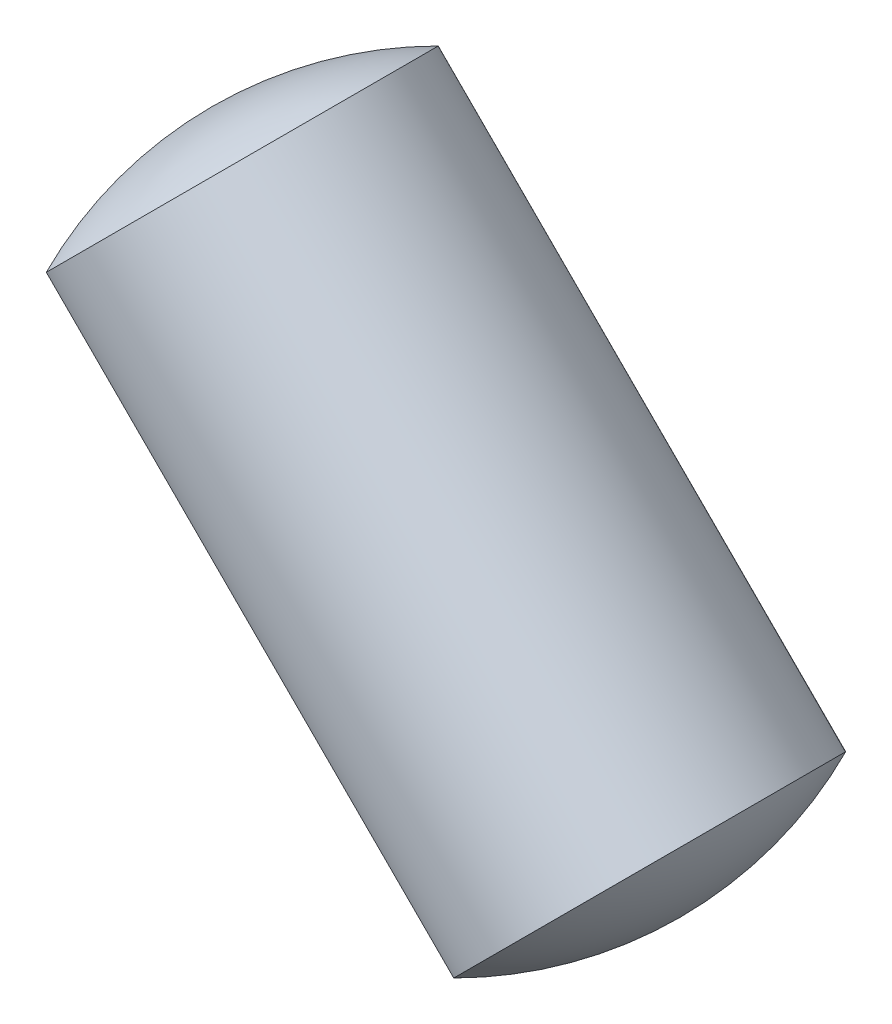
ISO-10303-21;
HEADER;
FILE_DESCRIPTION(('STEP AP214'),'2;1');
FILE_NAME('part.step','',(''),(''),'','','');
FILE_SCHEMA(('AUTOMOTIVE_DESIGN { 1 0 10303 214 1 1 1 1 }'));
ENDSEC;
DATA;
#1=APPLICATION_CONTEXT('core data for automotive mechanical design processes');
#2=APPLICATION_PROTOCOL_DEFINITION('international standard','automotive_design',2000,#1);
#3=PRODUCT_CONTEXT('',#1,'mechanical');
#4=PRODUCT('Part','Part','',(#3));
#5=PRODUCT_RELATED_PRODUCT_CATEGORY('part','',(#4));
#6=PRODUCT_DEFINITION_FORMATION('','',#4);
#7=PRODUCT_DEFINITION_CONTEXT('part definition',#1,'design');
#8=PRODUCT_DEFINITION('design','',#6,#7);
#9=PRODUCT_DEFINITION_SHAPE('','',#8);
#10=(LENGTH_UNIT() NAMED_UNIT(*) SI_UNIT(.MILLI.,.METRE.));
#11=(NAMED_UNIT(*) PLANE_ANGLE_UNIT() SI_UNIT($,.RADIAN.));
#12=(NAMED_UNIT(*) SI_UNIT($,.STERADIAN.) SOLID_ANGLE_UNIT());
#13=UNCERTAINTY_MEASURE_WITH_UNIT(LENGTH_MEASURE(1.E-05),#10,'distance_accuracy_value','');
#14=(GEOMETRIC_REPRESENTATION_CONTEXT(3) GLOBAL_UNCERTAINTY_ASSIGNED_CONTEXT((#13)) GLOBAL_UNIT_ASSIGNED_CONTEXT((#10,
#11,#12)) REPRESENTATION_CONTEXT('',''));
#15=CARTESIAN_POINT('',(0.,0.,0.));
#16=DIRECTION('',(0.,0.,1.));
#17=DIRECTION('',(1.,0.,0.));
#18=AXIS2_PLACEMENT_3D('',#15,#16,#17);
#19=CARTESIAN_POINT('',(-19.5175074847464,19.5175074847464,0.9));
#20=DIRECTION('',(0.707106781186548,0.707106781186548,0.));
#21=DIRECTION('',(-0.707106781186548,0.707106781186548,0.));
#22=AXIS2_PLACEMENT_3D('',#19,#20,#21);
#23=SPHERICAL_SURFACE('',#22,3.);
#24=CARTESIAN_POINT('',(-19.5175074847464,19.5175074847464,0.9));
#25=DIRECTION('',(0.707106781186548,-0.707106781186547,0.));
#26=DIRECTION('',(0.,0.,-1.));
#27=AXIS2_PLACEMENT_3D('',#24,#25,#26);
#28=SPHERICAL_SURFACE('',#27,3.);
#29=CARTESIAN_POINT('',(-21.3546247918337,21.3546247918337,0.9));
#30=DIRECTION('',(0.707106781186548,-0.707106781186547,0.));
#31=DIRECTION('',(0.,0.,-1.));
#32=AXIS2_PLACEMENT_3D('',#29,#30,#31);
#33=CIRCLE('',#32,1.5);
#34=CARTESIAN_POINT('',(-21.3546247918337,21.3546247918337,-0.6));
#35=VERTEX_POINT('',#34);
#36=EDGE_CURVE('E11',#35,#35,#33,.T.);
#37=ORIENTED_EDGE('',*,*,#36,.F.);
#38=EDGE_LOOP('',(#37));
#39=FACE_BOUND('',#38,.T.);
#40=ADVANCED_FACE('F17',(#39),#28,.T.);
#41=CARTESIAN_POINT('',(-19.3733654805138,19.3733654805139,0.9));
#42=DIRECTION('',(0.707106781186548,0.707106781186548,0.));
#43=DIRECTION('',(0.707106781186548,-0.707106781186548,0.));
#44=AXIS2_PLACEMENT_3D('',#41,#42,#43);
#45=SPHERICAL_SURFACE('',#44,3.);
#46=CARTESIAN_POINT('',(-19.3733654805138,19.3733654805139,0.9));
#47=DIRECTION('',(0.707106781186548,-0.707106781186547,0.));
#48=DIRECTION('',(0.,0.,-1.));
#49=AXIS2_PLACEMENT_3D('',#46,#47,#48);
#50=SPHERICAL_SURFACE('',#49,3.);
#51=CARTESIAN_POINT('',(-17.5362481734264,17.5362481734264,0.9));
#52=DIRECTION('',(0.707106781186548,-0.707106781186547,0.));
#53=DIRECTION('',(0.,0.,-1.));
#54=AXIS2_PLACEMENT_3D('',#51,#52,#53);
#55=CIRCLE('',#54,1.5);
#56=CARTESIAN_POINT('',(-17.5362481734264,17.5362481734264,-0.6));
#57=VERTEX_POINT('',#56);
#58=EDGE_CURVE('E20',#57,#57,#55,.T.);
#59=ORIENTED_EDGE('',*,*,#58,.T.);
#60=EDGE_LOOP('',(#59));
#61=FACE_BOUND('',#60,.T.);
#62=ADVANCED_FACE('F39',(#61),#50,.T.);
#63=CARTESIAN_POINT('',(-18.4908423280282,18.4908423280282,0.9));
#64=DIRECTION('',(0.707106781186548,-0.707106781186547,0.));
#65=DIRECTION('',(0.,0.,-1.));
#66=AXIS2_PLACEMENT_3D('',#63,#64,#65);
#67=CYLINDRICAL_SURFACE('',#66,1.5);
#68=ORIENTED_EDGE('',*,*,#36,.T.);
#69=EDGE_LOOP('',(#68));
#70=FACE_BOUND('',#69,.T.);
#71=ORIENTED_EDGE('',*,*,#58,.F.);
#72=EDGE_LOOP('',(#71));
#73=FACE_BOUND('',#72,.T.);
#74=ADVANCED_FACE('F47',(#70,#73),#67,.T.);
#75=CLOSED_SHELL('',(#40,#62,#74));
#76=MANIFOLD_SOLID_BREP('B1',#75);
#77=ADVANCED_BREP_SHAPE_REPRESENTATION('',(#18,#76),#14);
#78=SHAPE_DEFINITION_REPRESENTATION(#9,#77);
ENDSEC;
END-ISO-10303-21;
